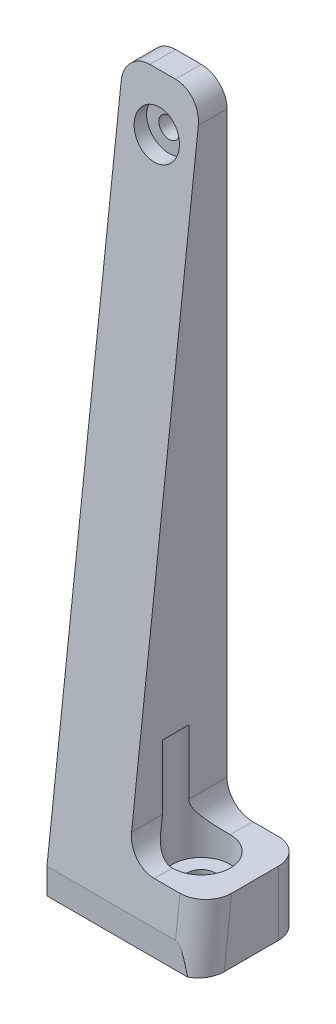
ISO-10303-21;
HEADER;
FILE_DESCRIPTION(('STEP AP214'),'2;1');
FILE_NAME('part.step','',(''),(''),'','','');
FILE_SCHEMA(('AUTOMOTIVE_DESIGN { 1 0 10303 214 1 1 1 1 }'));
ENDSEC;
DATA;
#1=APPLICATION_CONTEXT('core data for automotive mechanical design processes');
#2=APPLICATION_PROTOCOL_DEFINITION('international standard','automotive_design',2000,#1);
#3=PRODUCT_CONTEXT('',#1,'mechanical');
#4=PRODUCT('Part','Part','',(#3));
#5=PRODUCT_RELATED_PRODUCT_CATEGORY('part','',(#4));
#6=PRODUCT_DEFINITION_FORMATION('','',#4);
#7=PRODUCT_DEFINITION_CONTEXT('part definition',#1,'design');
#8=PRODUCT_DEFINITION('design','',#6,#7);
#9=PRODUCT_DEFINITION_SHAPE('','',#8);
#10=(LENGTH_UNIT() NAMED_UNIT(*) SI_UNIT(.MILLI.,.METRE.));
#11=(NAMED_UNIT(*) PLANE_ANGLE_UNIT() SI_UNIT($,.RADIAN.));
#12=(NAMED_UNIT(*) SI_UNIT($,.STERADIAN.) SOLID_ANGLE_UNIT());
#13=UNCERTAINTY_MEASURE_WITH_UNIT(LENGTH_MEASURE(1.E-05),#10,'distance_accuracy_value','');
#14=(GEOMETRIC_REPRESENTATION_CONTEXT(3) GLOBAL_UNCERTAINTY_ASSIGNED_CONTEXT((#13)) GLOBAL_UNIT_ASSIGNED_CONTEXT((#10,
#11,#12)) REPRESENTATION_CONTEXT('',''));
#15=CARTESIAN_POINT('',(0.,0.,0.));
#16=DIRECTION('',(0.,0.,1.));
#17=DIRECTION('',(1.,0.,0.));
#18=AXIS2_PLACEMENT_3D('',#15,#16,#17);
#19=CARTESIAN_POINT('',(-37.5,4.00000000000001,8.));
#20=DIRECTION('',(0.,-1.,0.));
#21=DIRECTION('',(1.,0.,0.));
#22=AXIS2_PLACEMENT_3D('',#19,#20,#21);
#23=CYLINDRICAL_SURFACE('',#22,2.2);
#24=CARTESIAN_POINT('',(-37.5,0.,8.));
#25=DIRECTION('',(0.,-1.,0.));
#26=DIRECTION('',(1.,0.,0.));
#27=AXIS2_PLACEMENT_3D('',#24,#25,#26);
#28=CIRCLE('',#27,2.2);
#29=CARTESIAN_POINT('',(-35.3,0.,8.));
#30=VERTEX_POINT('',#29);
#31=EDGE_CURVE('E197',#30,#30,#28,.T.);
#32=ORIENTED_EDGE('',*,*,#31,.T.);
#33=EDGE_LOOP('',(#32));
#34=FACE_BOUND('',#33,.T.);
#35=CARTESIAN_POINT('',(-37.5,6.00000000000001,8.));
#36=DIRECTION('',(0.,1.,0.));
#37=DIRECTION('',(-1.,0.,0.));
#38=AXIS2_PLACEMENT_3D('',#35,#36,#37);
#39=CIRCLE('',#38,2.2);
#40=CARTESIAN_POINT('',(-39.7,6.00000000000001,8.));
#41=VERTEX_POINT('',#40);
#42=EDGE_CURVE('E165',#41,#41,#39,.F.);
#43=ORIENTED_EDGE('',*,*,#42,.F.);
#44=EDGE_LOOP('',(#43));
#45=FACE_BOUND('',#44,.T.);
#46=ADVANCED_FACE('F39',(#34,#45),#23,.F.);
#47=CARTESIAN_POINT('',(-41.5,108.,4.));
#48=DIRECTION('',(-1.,0.,0.));
#49=DIRECTION('',(0.,-1.,0.));
#50=AXIS2_PLACEMENT_3D('',#47,#48,#49);
#51=PLANE('',#50);
#52=DIRECTION('',(0.,0.993408935871131,-0.11462410798513));
#53=VECTOR('',#52,1.);
#54=CARTESIAN_POINT('',(-41.5,108.,4.));
#55=LINE('',#54,#53);
#56=CARTESIAN_POINT('',(-41.5,14.,14.8461538461538));
#57=VERTEX_POINT('',#56);
#58=CARTESIAN_POINT('',(-41.5,104.,4.46153846153846));
#59=VERTEX_POINT('',#58);
#60=EDGE_CURVE('E188',#57,#59,#55,.T.);
#61=ORIENTED_EDGE('',*,*,#60,.F.);
#62=DIRECTION('',(0.,0.,1.));
#63=VECTOR('',#62,1.);
#64=CARTESIAN_POINT('',(-41.5,14.,4.));
#65=LINE('',#64,#63);
#66=CARTESIAN_POINT('',(-41.5,14.,10.0615528128088));
#67=VERTEX_POINT('',#66);
#68=EDGE_CURVE('E170',#57,#67,#65,.F.);
#69=ORIENTED_EDGE('',*,*,#68,.T.);
#70=DIRECTION('',(0.,-1.,0.));
#71=VECTOR('',#70,1.);
#72=CARTESIAN_POINT('',(-41.5,24.,10.0615528128088));
#73=LINE('',#72,#71);
#74=CARTESIAN_POINT('',(-41.5,24.,10.0615528128088));
#75=VERTEX_POINT('',#74);
#76=EDGE_CURVE('E161',#75,#67,#73,.T.);
#77=ORIENTED_EDGE('',*,*,#76,.F.);
#78=DIRECTION('',(0.,0.,-1.));
#79=VECTOR('',#78,1.);
#80=CARTESIAN_POINT('',(-41.5,24.,4.));
#81=LINE('',#80,#79);
#82=CARTESIAN_POINT('',(-41.5,24.,5.93844718719117));
#83=VERTEX_POINT('',#82);
#84=EDGE_CURVE('E145',#75,#83,#81,.T.);
#85=ORIENTED_EDGE('',*,*,#84,.T.);
#86=DIRECTION('',(0.,-1.,0.));
#87=VECTOR('',#86,1.);
#88=CARTESIAN_POINT('',(-41.5,24.,5.93844718719118));
#89=LINE('',#88,#87);
#90=CARTESIAN_POINT('',(-41.5,14.,5.93844718719118));
#91=VERTEX_POINT('',#90);
#92=EDGE_CURVE('E163',#91,#83,#89,.F.);
#93=ORIENTED_EDGE('',*,*,#92,.F.);
#94=DIRECTION('',(0.,0.,1.));
#95=VECTOR('',#94,1.);
#96=CARTESIAN_POINT('',(-41.5,14.,4.));
#97=LINE('',#96,#95);
#98=CARTESIAN_POINT('',(-41.5,14.,0.));
#99=VERTEX_POINT('',#98);
#100=EDGE_CURVE('E286',#91,#99,#97,.F.);
#101=ORIENTED_EDGE('',*,*,#100,.T.);
#102=DIRECTION('',(0.,1.,0.));
#103=VECTOR('',#102,1.);
#104=CARTESIAN_POINT('',(-41.5,108.,0.));
#105=LINE('',#104,#103);
#106=CARTESIAN_POINT('',(-41.5,104.,0.));
#107=VERTEX_POINT('',#106);
#108=EDGE_CURVE('E221',#99,#107,#105,.T.);
#109=ORIENTED_EDGE('',*,*,#108,.T.);
#110=DIRECTION('',(0.,0.,-1.));
#111=VECTOR('',#110,1.);
#112=CARTESIAN_POINT('',(-41.5,104.,4.));
#113=LINE('',#112,#111);
#114=EDGE_CURVE('E264',#107,#59,#113,.F.);
#115=ORIENTED_EDGE('',*,*,#114,.T.);
#116=EDGE_LOOP('',(#61,#69,#77,#85,#93,#101,#109,#115));
#117=FACE_BOUND('',#116,.T.);
#118=ADVANCED_FACE('F168',(#117),#51,.F.);
#119=CARTESIAN_POINT('',(0.,0.,0.));
#120=DIRECTION('',(0.,0.,-1.));
#121=DIRECTION('',(-1.,0.,0.));
#122=AXIS2_PLACEMENT_3D('',#119,#120,#121);
#123=PLANE('',#122);
#124=DIRECTION('',(-1.,0.,0.));
#125=VECTOR('',#124,1.);
#126=CARTESIAN_POINT('',(-29.5,10.,0.));
#127=LINE('',#126,#125);
#128=CARTESIAN_POINT('',(-33.5,10.,0.));
#129=VERTEX_POINT('',#128);
#130=CARTESIAN_POINT('',(-37.5,10.,0.));
#131=VERTEX_POINT('',#130);
#132=EDGE_CURVE('E180',#129,#131,#127,.T.);
#133=ORIENTED_EDGE('',*,*,#132,.F.);
#134=DIRECTION('',(0.,-1.,0.));
#135=VECTOR('',#134,1.);
#136=CARTESIAN_POINT('',(-33.5,0.,0.));
#137=LINE('',#136,#135);
#138=CARTESIAN_POINT('',(-33.5,0.,0.));
#139=VERTEX_POINT('',#138);
#140=EDGE_CURVE('E405',#129,#139,#137,.T.);
#141=ORIENTED_EDGE('',*,*,#140,.T.);
#142=DIRECTION('',(1.,0.,0.));
#143=VECTOR('',#142,1.);
#144=CARTESIAN_POINT('',(-41.5,0.,0.));
#145=LINE('',#144,#143);
#146=CARTESIAN_POINT('',(-53.5,0.,0.));
#147=VERTEX_POINT('',#146);
#148=EDGE_CURVE('E228',#147,#139,#145,.T.);
#149=ORIENTED_EDGE('',*,*,#148,.F.);
#150=DIRECTION('',(0.,-1.,0.));
#151=VECTOR('',#150,1.);
#152=CARTESIAN_POINT('',(-53.5,108.,0.));
#153=LINE('',#152,#151);
#154=CARTESIAN_POINT('',(-53.5,104.,0.));
#155=VERTEX_POINT('',#154);
#156=EDGE_CURVE('E225',#155,#147,#153,.T.);
#157=ORIENTED_EDGE('',*,*,#156,.F.);
#158=CARTESIAN_POINT('',(-49.5,104.,0.));
#159=DIRECTION('',(0.,0.,-1.));
#160=DIRECTION('',(-1.,0.,0.));
#161=AXIS2_PLACEMENT_3D('',#158,#159,#160);
#162=CIRCLE('',#161,4.);
#163=CARTESIAN_POINT('',(-49.5,108.,0.));
#164=VERTEX_POINT('',#163);
#165=EDGE_CURVE('E257',#155,#164,#162,.T.);
#166=ORIENTED_EDGE('',*,*,#165,.T.);
#167=DIRECTION('',(-1.,0.,0.));
#168=VECTOR('',#167,1.);
#169=CARTESIAN_POINT('',(-53.5,108.,0.));
#170=LINE('',#169,#168);
#171=CARTESIAN_POINT('',(-45.5,108.,0.));
#172=VERTEX_POINT('',#171);
#173=EDGE_CURVE('E216',#172,#164,#170,.T.);
#174=ORIENTED_EDGE('',*,*,#173,.F.);
#175=CARTESIAN_POINT('',(-45.5,104.,0.));
#176=DIRECTION('',(0.,0.,-1.));
#177=DIRECTION('',(-1.,0.,0.));
#178=AXIS2_PLACEMENT_3D('',#175,#176,#177);
#179=CIRCLE('',#178,4.);
#180=EDGE_CURVE('E260',#172,#107,#179,.T.);
#181=ORIENTED_EDGE('',*,*,#180,.T.);
#182=ORIENTED_EDGE('',*,*,#108,.F.);
#183=CARTESIAN_POINT('',(-37.5,14.,0.));
#184=DIRECTION('',(0.,0.,-1.));
#185=DIRECTION('',(-1.,0.,0.));
#186=AXIS2_PLACEMENT_3D('',#183,#184,#185);
#187=CIRCLE('',#186,4.);
#188=EDGE_CURVE('E408',#99,#131,#187,.F.);
#189=ORIENTED_EDGE('',*,*,#188,.T.);
#190=EDGE_LOOP('',(#133,#141,#149,#157,#166,#174,#181,#182,#189));
#191=FACE_BOUND('',#190,.T.);
#192=CARTESIAN_POINT('',(-47.5,100.,0.));
#193=DIRECTION('',(0.,0.,1.));
#194=DIRECTION('',(1.,0.,0.));
#195=AXIS2_PLACEMENT_3D('',#192,#193,#194);
#196=CIRCLE('',#195,1.6);
#197=CARTESIAN_POINT('',(-45.9,100.,0.));
#198=VERTEX_POINT('',#197);
#199=EDGE_CURVE('E212',#198,#198,#196,.T.);
#200=ORIENTED_EDGE('',*,*,#199,.T.);
#201=EDGE_LOOP('',(#200));
#202=FACE_BOUND('',#201,.T.);
#203=ADVANCED_FACE('F343',(#191,#202),#123,.T.);
#204=CARTESIAN_POINT('',(-53.5,108.,4.));
#205=DIRECTION('',(0.,-1.,0.));
#206=DIRECTION('',(0.,0.,-1.));
#207=AXIS2_PLACEMENT_3D('',#204,#205,#206);
#208=PLANE('',#207);
#209=DIRECTION('',(-1.,0.,0.));
#210=VECTOR('',#209,1.);
#211=CARTESIAN_POINT('',(-53.5,108.,4.));
#212=LINE('',#211,#210);
#213=CARTESIAN_POINT('',(-45.5,108.,4.));
#214=VERTEX_POINT('',#213);
#215=CARTESIAN_POINT('',(-49.5,108.,4.));
#216=VERTEX_POINT('',#215);
#217=EDGE_CURVE('E217',#214,#216,#212,.T.);
#218=ORIENTED_EDGE('',*,*,#217,.F.);
#219=DIRECTION('',(0.,0.,-1.));
#220=VECTOR('',#219,1.);
#221=CARTESIAN_POINT('',(-45.5,108.,4.));
#222=LINE('',#221,#220);
#223=EDGE_CURVE('E253',#214,#172,#222,.T.);
#224=ORIENTED_EDGE('',*,*,#223,.T.);
#225=ORIENTED_EDGE('',*,*,#173,.T.);
#226=DIRECTION('',(0.,0.,-1.));
#227=VECTOR('',#226,1.);
#228=CARTESIAN_POINT('',(-49.5,108.,4.));
#229=LINE('',#228,#227);
#230=EDGE_CURVE('E153',#164,#216,#229,.F.);
#231=ORIENTED_EDGE('',*,*,#230,.T.);
#232=EDGE_LOOP('',(#218,#224,#225,#231));
#233=FACE_BOUND('',#232,.T.);
#234=ADVANCED_FACE('F346',(#233),#208,.F.);
#235=CARTESIAN_POINT('',(-53.5,108.,4.));
#236=DIRECTION('',(1.,0.,0.));
#237=DIRECTION('',(0.,0.,-1.));
#238=AXIS2_PLACEMENT_3D('',#235,#236,#237);
#239=PLANE('',#238);
#240=DIRECTION('',(0.,0.993408935871131,-0.11462410798513));
#241=VECTOR('',#240,1.);
#242=CARTESIAN_POINT('',(-53.5,108.,4.));
#243=LINE('',#242,#241);
#244=CARTESIAN_POINT('',(-53.5,4.00000000000002,16.));
#245=VERTEX_POINT('',#244);
#246=CARTESIAN_POINT('',(-53.5,104.,4.46153846153846));
#247=VERTEX_POINT('',#246);
#248=EDGE_CURVE('E187',#245,#247,#243,.T.);
#249=ORIENTED_EDGE('',*,*,#248,.T.);
#250=DIRECTION('',(0.,0.,-1.));
#251=VECTOR('',#250,1.);
#252=CARTESIAN_POINT('',(-53.5,104.,4.));
#253=LINE('',#252,#251);
#254=EDGE_CURVE('E274',#247,#155,#253,.T.);
#255=ORIENTED_EDGE('',*,*,#254,.T.);
#256=ORIENTED_EDGE('',*,*,#156,.T.);
#257=DIRECTION('',(0.,0.,-1.));
#258=VECTOR('',#257,1.);
#259=CARTESIAN_POINT('',(-53.5,0.,4.));
#260=LINE('',#259,#258);
#261=CARTESIAN_POINT('',(-53.5,0.,16.));
#262=VERTEX_POINT('',#261);
#263=EDGE_CURVE('E154',#262,#147,#260,.T.);
#264=ORIENTED_EDGE('',*,*,#263,.F.);
#265=DIRECTION('',(0.,-1.,0.));
#266=VECTOR('',#265,1.);
#267=CARTESIAN_POINT('',(-53.5,4.00000000000002,16.));
#268=LINE('',#267,#266);
#269=EDGE_CURVE('E208',#245,#262,#268,.T.);
#270=ORIENTED_EDGE('',*,*,#269,.F.);
#271=EDGE_LOOP('',(#249,#255,#256,#264,#270));
#272=FACE_BOUND('',#271,.T.);
#273=ADVANCED_FACE('F352',(#272),#239,.F.);
#274=CARTESIAN_POINT('',(-41.5,0.,4.));
#275=DIRECTION('',(0.,1.,0.));
#276=DIRECTION('',(-1.,0.,0.));
#277=AXIS2_PLACEMENT_3D('',#274,#275,#276);
#278=PLANE('',#277);
#279=ORIENTED_EDGE('',*,*,#148,.T.);
#280=CARTESIAN_POINT('',(-33.5,0.,4.));
#281=DIRECTION('',(0.,1.,0.));
#282=DIRECTION('',(-1.,0.,0.));
#283=AXIS2_PLACEMENT_3D('',#280,#281,#282);
#284=CIRCLE('',#283,4.);
#285=CARTESIAN_POINT('',(-29.5,0.,4.));
#286=VERTEX_POINT('',#285);
#287=EDGE_CURVE('E399',#139,#286,#284,.F.);
#288=ORIENTED_EDGE('',*,*,#287,.T.);
#289=DIRECTION('',(0.,0.,1.));
#290=VECTOR('',#289,1.);
#291=CARTESIAN_POINT('',(-29.5,0.,0.));
#292=LINE('',#291,#290);
#293=CARTESIAN_POINT('',(-29.5,0.,12.4349992835993));
#294=VERTEX_POINT('',#293);
#295=EDGE_CURVE('E201',#286,#294,#292,.T.);
#296=ORIENTED_EDGE('',*,*,#295,.T.);
#297=CARTESIAN_POINT('',(-33.5,0.,12.4349992835993));
#298=DIRECTION('',(0.,1.,0.));
#299=DIRECTION('',(0.,0.,1.));
#300=AXIS2_PLACEMENT_3D('',#297,#298,#299);
#301=ELLIPSE('',#300,4.0265391779392,4.);
#302=CARTESIAN_POINT('',(-31.6404967121777,0.,16.));
#303=VERTEX_POINT('',#302);
#304=EDGE_CURVE('E402',#294,#303,#301,.F.);
#305=ORIENTED_EDGE('',*,*,#304,.T.);
#306=DIRECTION('',(-1.,0.,0.));
#307=VECTOR('',#306,1.);
#308=CARTESIAN_POINT('',(-29.5,0.,16.));
#309=LINE('',#308,#307);
#310=EDGE_CURVE('E205',#303,#262,#309,.T.);
#311=ORIENTED_EDGE('',*,*,#310,.T.);
#312=ORIENTED_EDGE('',*,*,#263,.T.);
#313=EDGE_LOOP('',(#279,#288,#296,#305,#311,#312));
#314=FACE_BOUND('',#313,.T.);
#315=ORIENTED_EDGE('',*,*,#31,.F.);
#316=EDGE_LOOP('',(#315));
#317=FACE_BOUND('',#316,.T.);
#318=ADVANCED_FACE('F341',(#314,#317),#278,.F.);
#319=CARTESIAN_POINT('',(-47.5,100.,4.));
#320=DIRECTION('',(0.,0.,-1.));
#321=DIRECTION('',(-1.,0.,0.));
#322=AXIS2_PLACEMENT_3D('',#319,#320,#321);
#323=CYLINDRICAL_SURFACE('',#322,1.6);
#324=CARTESIAN_POINT('',(-47.5,100.,3.));
#325=DIRECTION('',(0.,0.,-1.));
#326=DIRECTION('',(-1.,0.,0.));
#327=AXIS2_PLACEMENT_3D('',#324,#325,#326);
#328=CIRCLE('',#327,1.6);
#329=CARTESIAN_POINT('',(-49.1,100.,3.));
#330=VERTEX_POINT('',#329);
#331=EDGE_CURVE('E245',#330,#330,#328,.T.);
#332=ORIENTED_EDGE('',*,*,#331,.F.);
#333=EDGE_LOOP('',(#332));
#334=FACE_BOUND('',#333,.T.);
#335=ORIENTED_EDGE('',*,*,#199,.F.);
#336=EDGE_LOOP('',(#335));
#337=FACE_BOUND('',#336,.T.);
#338=ADVANCED_FACE('F335',(#334,#337),#323,.F.);
#339=CARTESIAN_POINT('',(-29.5,4.00000000000001,16.));
#340=DIRECTION('',(0.,0.,1.));
#341=DIRECTION('',(1.,0.,0.));
#342=AXIS2_PLACEMENT_3D('',#339,#340,#341);
#343=PLANE('',#342);
#344=ORIENTED_EDGE('',*,*,#310,.F.);
#345=CARTESIAN_POINT('',(-33.5,-30.8966728754731,16.));
#346=DIRECTION('',(0.,0.,1.));
#347=DIRECTION('',(0.,-1.,0.));
#348=AXIS2_PLACEMENT_3D('',#345,#346,#347);
#349=ELLIPSE('',#348,34.8966728754731,4.);
#350=CARTESIAN_POINT('',(-33.5,4.00000000000002,16.));
#351=VERTEX_POINT('',#350);
#352=EDGE_CURVE('E48',#303,#351,#349,.T.);
#353=ORIENTED_EDGE('',*,*,#352,.T.);
#354=DIRECTION('',(-1.,0.,0.));
#355=VECTOR('',#354,1.);
#356=CARTESIAN_POINT('',(-41.5,4.00000000000002,16.));
#357=LINE('',#356,#355);
#358=EDGE_CURVE('E191',#351,#245,#357,.T.);
#359=ORIENTED_EDGE('',*,*,#358,.T.);
#360=ORIENTED_EDGE('',*,*,#269,.T.);
#361=EDGE_LOOP('',(#344,#353,#359,#360));
#362=FACE_BOUND('',#361,.T.);
#363=ADVANCED_FACE('F332',(#362),#343,.T.);
#364=CARTESIAN_POINT('',(-29.5,4.00000000000001,0.));
#365=DIRECTION('',(1.,0.,0.));
#366=DIRECTION('',(0.,1.,0.));
#367=AXIS2_PLACEMENT_3D('',#364,#365,#366);
#368=PLANE('',#367);
#369=ORIENTED_EDGE('',*,*,#295,.F.);
#370=DIRECTION('',(0.,-1.,0.));
#371=VECTOR('',#370,1.);
#372=CARTESIAN_POINT('',(-29.5,4.00000000000001,4.));
#373=LINE('',#372,#371);
#374=CARTESIAN_POINT('',(-29.5,10.,4.));
#375=VERTEX_POINT('',#374);
#376=EDGE_CURVE('E389',#286,#375,#373,.F.);
#377=ORIENTED_EDGE('',*,*,#376,.T.);
#378=DIRECTION('',(0.,0.,-1.));
#379=VECTOR('',#378,1.);
#380=CARTESIAN_POINT('',(-29.5,10.,16.));
#381=LINE('',#380,#379);
#382=CARTESIAN_POINT('',(-29.5,10.,11.2811531297531));
#383=VERTEX_POINT('',#382);
#384=EDGE_CURVE('E183',#383,#375,#381,.T.);
#385=ORIENTED_EDGE('',*,*,#384,.F.);
#386=DIRECTION('',(0.,-0.993408935871131,0.11462410798513));
#387=VECTOR('',#386,1.);
#388=CARTESIAN_POINT('',(-29.5,5.36340137827846,11.8161452784133));
#389=LINE('',#388,#387);
#390=EDGE_CURVE('E385',#383,#294,#389,.T.);
#391=ORIENTED_EDGE('',*,*,#390,.T.);
#392=EDGE_LOOP('',(#369,#377,#385,#391));
#393=FACE_BOUND('',#392,.T.);
#394=ADVANCED_FACE('F327',(#393),#368,.T.);
#395=CARTESIAN_POINT('',(-41.5,108.,4.));
#396=DIRECTION('',(0.,0.11462410798513,0.993408935871131));
#397=DIRECTION('',(0.,-0.993408935871131,0.11462410798513));
#398=AXIS2_PLACEMENT_3D('',#395,#396,#397);
#399=PLANE('',#398);
#400=CARTESIAN_POINT('',(-47.5,100.,4.92307692307692));
#401=DIRECTION('',(0.,0.11462410798513,0.993408935871131));
#402=DIRECTION('',(0.,0.993408935871131,-0.11462410798513));
#403=AXIS2_PLACEMENT_3D('',#400,#401,#402);
#404=ELLIPSE('',#403,3.5232217806968,3.5);
#405=CARTESIAN_POINT('',(-47.5,103.5,4.51923076923077));
#406=VERTEX_POINT('',#405);
#407=EDGE_CURVE('E241',#406,#406,#404,.T.);
#408=ORIENTED_EDGE('',*,*,#407,.F.);
#409=EDGE_LOOP('',(#408));
#410=FACE_BOUND('',#409,.T.);
#411=ORIENTED_EDGE('',*,*,#358,.F.);
#412=DIRECTION('',(0.,-0.993408935871131,0.11462410798513));
#413=VECTOR('',#412,1.);
#414=CARTESIAN_POINT('',(-33.5,108.,4.));
#415=LINE('',#414,#413);
#416=CARTESIAN_POINT('',(-33.5,10.,15.3076923076923));
#417=VERTEX_POINT('',#416);
#418=EDGE_CURVE('E11',#351,#417,#415,.F.);
#419=ORIENTED_EDGE('',*,*,#418,.T.);
#420=DIRECTION('',(-1.,0.,0.));
#421=VECTOR('',#420,1.);
#422=CARTESIAN_POINT('',(-29.5,10.,15.3076923076923));
#423=LINE('',#422,#421);
#424=CARTESIAN_POINT('',(-37.5,10.,15.3076923076923));
#425=VERTEX_POINT('',#424);
#426=EDGE_CURVE('E174',#417,#425,#423,.T.);
#427=ORIENTED_EDGE('',*,*,#426,.T.);
#428=CARTESIAN_POINT('',(-37.5,14.,14.8461538461538));
#429=DIRECTION('',(0.,0.11462410798513,0.993408935871131));
#430=DIRECTION('',(0.,-0.993408935871131,0.114624107985131));
#431=AXIS2_PLACEMENT_3D('',#428,#429,#430);
#432=ELLIPSE('',#431,4.0265391779392,4.);
#433=EDGE_CURVE('E291',#425,#57,#432,.F.);
#434=ORIENTED_EDGE('',*,*,#433,.T.);
#435=ORIENTED_EDGE('',*,*,#60,.T.);
#436=CARTESIAN_POINT('',(-45.5,104.,4.46153846153846));
#437=DIRECTION('',(0.,0.11462410798513,0.993408935871131));
#438=DIRECTION('',(0.,0.993408935871131,-0.114624107985131));
#439=AXIS2_PLACEMENT_3D('',#436,#437,#438);
#440=ELLIPSE('',#439,4.0265391779392,4.);
#441=EDGE_CURVE('E271',#59,#214,#440,.T.);
#442=ORIENTED_EDGE('',*,*,#441,.T.);
#443=ORIENTED_EDGE('',*,*,#217,.T.);
#444=CARTESIAN_POINT('',(-49.5,104.,4.46153846153846));
#445=DIRECTION('',(0.,0.11462410798513,0.993408935871131));
#446=DIRECTION('',(0.,0.993408935871131,-0.114624107985131));
#447=AXIS2_PLACEMENT_3D('',#444,#445,#446);
#448=ELLIPSE('',#447,4.0265391779392,4.);
#449=EDGE_CURVE('E268',#216,#247,#448,.T.);
#450=ORIENTED_EDGE('',*,*,#449,.T.);
#451=ORIENTED_EDGE('',*,*,#248,.F.);
#452=EDGE_LOOP('',(#411,#419,#427,#434,#435,#442,#443,#450,#451));
#453=FACE_BOUND('',#452,.T.);
#454=ADVANCED_FACE('F323',(#410,#453),#399,.T.);
#455=CARTESIAN_POINT('',(0.,10.,0.));
#456=DIRECTION('',(0.,1.,0.));
#457=DIRECTION('',(-1.,0.,0.));
#458=AXIS2_PLACEMENT_3D('',#455,#456,#457);
#459=PLANE('',#458);
#460=ORIENTED_EDGE('',*,*,#384,.T.);
#461=CARTESIAN_POINT('',(-33.5,10.,4.));
#462=DIRECTION('',(0.,1.,0.));
#463=DIRECTION('',(-1.,0.,0.));
#464=AXIS2_PLACEMENT_3D('',#461,#462,#463);
#465=CIRCLE('',#464,4.);
#466=EDGE_CURVE('E388',#375,#129,#465,.T.);
#467=ORIENTED_EDGE('',*,*,#466,.T.);
#468=ORIENTED_EDGE('',*,*,#132,.T.);
#469=DIRECTION('',(0.,0.,1.));
#470=VECTOR('',#469,1.);
#471=CARTESIAN_POINT('',(-37.5,10.,0.));
#472=LINE('',#471,#470);
#473=CARTESIAN_POINT('',(-37.5,10.,3.5));
#474=VERTEX_POINT('',#473);
#475=EDGE_CURVE('E278',#131,#474,#472,.T.);
#476=ORIENTED_EDGE('',*,*,#475,.T.);
#477=CARTESIAN_POINT('',(-37.5,10.,8.));
#478=DIRECTION('',(0.,1.,0.));
#479=DIRECTION('',(-1.,0.,0.));
#480=AXIS2_PLACEMENT_3D('',#477,#478,#479);
#481=CIRCLE('',#480,4.5);
#482=CARTESIAN_POINT('',(-37.5,10.,12.5));
#483=VERTEX_POINT('',#482);
#484=EDGE_CURVE('E250',#483,#474,#481,.T.);
#485=ORIENTED_EDGE('',*,*,#484,.F.);
#486=DIRECTION('',(0.,0.,1.));
#487=VECTOR('',#486,1.);
#488=CARTESIAN_POINT('',(-37.5,10.,0.));
#489=LINE('',#488,#487);
#490=EDGE_CURVE('E282',#483,#425,#489,.T.);
#491=ORIENTED_EDGE('',*,*,#490,.T.);
#492=ORIENTED_EDGE('',*,*,#426,.F.);
#493=CARTESIAN_POINT('',(-33.5,10.,11.2811531297531));
#494=DIRECTION('',(0.,1.,0.));
#495=DIRECTION('',(0.,0.,1.));
#496=AXIS2_PLACEMENT_3D('',#493,#494,#495);
#497=ELLIPSE('',#496,4.0265391779392,4.);
#498=EDGE_CURVE('E383',#417,#383,#497,.T.);
#499=ORIENTED_EDGE('',*,*,#498,.T.);
#500=EDGE_LOOP('',(#460,#467,#468,#476,#485,#491,#492,#499));
#501=FACE_BOUND('',#500,.T.);
#502=ADVANCED_FACE('F319',(#501),#459,.T.);
#503=CARTESIAN_POINT('',(-37.5,24.,8.));
#504=DIRECTION('',(0.,1.,0.));
#505=DIRECTION('',(-1.,0.,0.));
#506=AXIS2_PLACEMENT_3D('',#503,#504,#505);
#507=PLANE('',#506);
#508=CARTESIAN_POINT('',(-37.5,24.,8.));
#509=DIRECTION('',(0.,1.,0.));
#510=DIRECTION('',(-1.,0.,0.));
#511=AXIS2_PLACEMENT_3D('',#508,#509,#510);
#512=CIRCLE('',#511,4.5);
#513=EDGE_CURVE('E148',#83,#75,#512,.T.);
#514=ORIENTED_EDGE('',*,*,#513,.F.);
#515=ORIENTED_EDGE('',*,*,#84,.F.);
#516=EDGE_LOOP('',(#514,#515));
#517=FACE_BOUND('',#516,.T.);
#518=ADVANCED_FACE('F147',(#517),#507,.F.);
#519=CARTESIAN_POINT('',(-37.5,24.,8.));
#520=DIRECTION('',(0.,-1.,0.));
#521=DIRECTION('',(1.,0.,0.));
#522=AXIS2_PLACEMENT_3D('',#519,#520,#521);
#523=CYLINDRICAL_SURFACE('',#522,4.5);
#524=ORIENTED_EDGE('',*,*,#484,.T.);
#525=CARTESIAN_POINT('',(-37.5,10.,3.5));
#526=CARTESIAN_POINT('',(-37.5935869277815,9.99997800695673,3.49997732016334));
#527=CARTESIAN_POINT('',(-37.687156797297,10.0032836887174,3.50291876284296));
#528=CARTESIAN_POINT('',(-37.8734143333226,10.0163804736635,3.5145559746189));
#529=CARTESIAN_POINT('',(-37.9661025981245,10.0261668046063,3.52324750943817));
#530=CARTESIAN_POINT('',(-38.1491468000912,10.051950895096,3.54611874203927));
#531=CARTESIAN_POINT('',(-38.2395155267506,10.0678978611754,3.56025355788471));
#532=CARTESIAN_POINT('',(-38.4180157282959,10.1056987412168,3.59369703334118));
#533=CARTESIAN_POINT('',(-38.5061469027344,10.1275534438993,3.6130063837827));
#534=CARTESIAN_POINT('',(-38.7658277286531,10.201326919836,3.67803669178848));
#535=CARTESIAN_POINT('',(-38.9333270330033,10.2615519478014,3.73094659330094));
#536=CARTESIAN_POINT('',(-39.2542611124496,10.4009224153535,3.85244586413752));
#537=CARTESIAN_POINT('',(-39.4076648652779,10.4801082671283,3.92106870942376));
#538=CARTESIAN_POINT('',(-39.7559391704925,10.6884354919409,4.09968040752454));
#539=CARTESIAN_POINT('',(-39.9435168498034,10.8249952216363,4.21534377942057));
#540=CARTESIAN_POINT('',(-40.2013307346172,11.0477478038759,4.39943526585387));
#541=CARTESIAN_POINT('',(-40.2834444706305,11.1251085661798,4.46266391438559));
#542=CARTESIAN_POINT('',(-40.4399407571454,11.2853600091235,4.59162794643619));
#543=CARTESIAN_POINT('',(-40.5143259403957,11.3682487907284,4.65736246582516));
#544=CARTESIAN_POINT('',(-40.6570064992906,11.5411066126383,4.79170929534566));
#545=CARTESIAN_POINT('',(-40.7251306645027,11.6311917503987,4.86035309831985));
#546=CARTESIAN_POINT('',(-40.8535015286027,11.8167100005457,4.99785575690581));
#547=CARTESIAN_POINT('',(-40.913745958653,11.912144641982,5.06671466863667));
#548=CARTESIAN_POINT('',(-41.0263224477614,12.1084772015641,5.20306277743122));
#549=CARTESIAN_POINT('',(-41.0786562798222,12.2093738885955,5.27055227847644));
#550=CARTESIAN_POINT('',(-41.1752385804629,12.4170509512852,5.40206474617694));
#551=CARTESIAN_POINT('',(-41.2194924828965,12.5238273094238,5.46609002202591));
#552=CARTESIAN_POINT('',(-41.3025429528411,12.7523768640452,5.59235052911703));
#553=CARTESIAN_POINT('',(-41.3406781881425,12.8746739379656,5.65408843951791));
#554=CARTESIAN_POINT('',(-41.4057912019411,13.1272736828094,5.76418567723444));
#555=CARTESIAN_POINT('',(-41.4328415178264,13.2575176840495,5.81263127344617));
#556=CARTESIAN_POINT('',(-41.4684969943952,13.489380663872,5.8781965051382));
#557=CARTESIAN_POINT('',(-41.4801244173054,13.5890750701833,5.90026118955214));
#558=CARTESIAN_POINT('',(-41.4919516231496,13.7412307617615,5.92288835694849));
#559=CARTESIAN_POINT('',(-41.4949591749726,13.7927189856223,5.92868847826483));
#560=CARTESIAN_POINT('',(-41.4989875610931,13.8961289417571,5.93648195442941));
#561=CARTESIAN_POINT('',(-41.5000056558492,13.9480511730703,5.93847005994807));
#562=CARTESIAN_POINT('',(-41.5,14.,5.93844718719113));
#563=B_SPLINE_CURVE_WITH_KNOTS('',3,(#525,#526,#527,#528,#529,#530,#531,#532,#533,#534,#535,
#536,#537,#538,#539,#540,#541,#542,#543,#544,#545,#546,#547,#548,#549,#550,#551,#552,#553,#554,
#555,#556,#557,#558,#559,#560,#561,#562),.UNSPECIFIED.,.F.,.F.,(4,2,2,2,2,2,2,2,2,2,2,2,2,2,2,2,
2,2,4),(0.,0.280628406979089,0.561050393307285,0.839208057613605,1.11740287610307,
1.67179423998445,2.2273778926858,3.00057555114543,3.38829291333553,3.77587776269374,
4.17204043572344,4.56831692721267,4.96450446911055,5.36042458055966,5.78614020494531,
6.20902375173169,6.51613986750651,6.6716773354168,6.82742883253023),.UNSPECIFIED.);
#564=EDGE_CURVE('E303',#474,#91,#563,.T.);
#565=ORIENTED_EDGE('',*,*,#564,.T.);
#566=ORIENTED_EDGE('',*,*,#92,.T.);
#567=ORIENTED_EDGE('',*,*,#513,.T.);
#568=ORIENTED_EDGE('',*,*,#76,.T.);
#569=CARTESIAN_POINT('',(-41.5,14.,10.0615528128088));
#570=CARTESIAN_POINT('',(-41.5000155768564,13.9372367308244,10.0614946775051));
#571=CARTESIAN_POINT('',(-41.4985235386135,13.8745129894339,10.0644177155635));
#572=CARTESIAN_POINT('',(-41.4926528598452,13.7498542576007,10.0757633938085));
#573=CARTESIAN_POINT('',(-41.488281495451,13.6879176790649,10.0841721708807));
#574=CARTESIAN_POINT('',(-41.4768799581347,13.566291629854,10.1058401713004));
#575=CARTESIAN_POINT('',(-41.469897498057,13.5065818074312,10.1190122203163));
#576=CARTESIAN_POINT('',(-41.4534423206775,13.3885715427146,10.1495573474808));
#577=CARTESIAN_POINT('',(-41.4439678513785,13.3302721236126,10.1669333805319));
#578=CARTESIAN_POINT('',(-41.4176608927338,13.1879839924233,10.2142648241426));
#579=CARTESIAN_POINT('',(-41.3994701812385,13.1049314627165,10.2462769808714));
#580=CARTESIAN_POINT('',(-41.3585545996425,12.9423648954616,10.3158553633833));
#581=CARTESIAN_POINT('',(-41.3358274173946,12.8628526877233,10.353424418866));
#582=CARTESIAN_POINT('',(-41.2859524001824,12.7064122323948,10.4328552019245));
#583=CARTESIAN_POINT('',(-41.258763694152,12.6295166645273,10.4747551491688));
#584=CARTESIAN_POINT('',(-41.2003513289189,12.4788396724066,10.5612753396795));
#585=CARTESIAN_POINT('',(-41.1691261956842,12.4050593989265,10.605896573552));
#586=CARTESIAN_POINT('',(-41.081253900533,12.2134215478651,10.7263922959353));
#587=CARTESIAN_POINT('',(-41.0212574204478,12.0980256429766,10.8037600137751));
#588=CARTESIAN_POINT('',(-40.8909082783797,11.8743242550421,10.9600898617294));
#589=CARTESIAN_POINT('',(-40.8205496132177,11.7660229350426,11.0390528930303));
#590=CARTESIAN_POINT('',(-40.6696654850104,11.5566799650746,11.1960981140677));
#591=CARTESIAN_POINT('',(-40.5891696547173,11.4556184507486,11.2741821763209));
#592=CARTESIAN_POINT('',(-40.4177766679973,11.2607657529866,11.4278022960806));
#593=CARTESIAN_POINT('',(-40.3268844779944,11.1669711337197,11.5033395480735));
#594=CARTESIAN_POINT('',(-40.0838610150479,10.9399281296902,11.688869638711));
#595=CARTESIAN_POINT('',(-39.9246467464296,10.8118451662036,11.7961115617957));
#596=CARTESIAN_POINT('',(-39.581625982894,10.5780484483069,11.9944921586391));
#597=CARTESIAN_POINT('',(-39.3978505650695,10.4723068548425,12.0856508496766));
#598=CARTESIAN_POINT('',(-39.0451061894216,10.3063532784273,12.2298568665661));
#599=CARTESIAN_POINT('',(-38.8800486890992,10.2412994863127,12.2868599505602));
#600=CARTESIAN_POINT('',(-38.5379811422018,10.1328804064039,12.3822306779714));
#601=CARTESIAN_POINT('',(-38.3609963525321,10.0894708278991,12.4206363726776));
#602=CARTESIAN_POINT('',(-38.0689627913542,10.0390543211306,12.4653122472997));
#603=CARTESIAN_POINT('',(-37.9561746469432,10.0244720164398,12.4782573856558));
#604=CARTESIAN_POINT('',(-37.7289546272975,10.0049195934772,12.4956268429097));
#605=CARTESIAN_POINT('',(-37.6145205556903,9.99996381212633,12.5000384526585));
#606=CARTESIAN_POINT('',(-37.5,10.,12.5));
#607=B_SPLINE_CURVE_WITH_KNOTS('',3,(#569,#570,#571,#572,#573,#574,#575,#576,#577,#578,#579,
#580,#581,#582,#583,#584,#585,#586,#587,#588,#589,#590,#591,#592,#593,#594,#595,#596,#597,#598,
#599,#600,#601,#602,#603,#604,#605,#606),.UNSPECIFIED.,.F.,.F.,(4,2,2,2,2,2,2,2,2,2,2,2,2,2,2,2,
2,2,4),(0.,0.188140947284096,0.375808272236812,0.560201767343891,0.744725247693048,
1.01680277287632,1.28901932618973,1.56388521462064,1.83885176430151,2.29222647389656,
2.7458648802459,3.19820673040138,3.65033338868983,4.34002941424762,5.02886089011197,
5.58568901362802,6.14137297081858,6.48407612367843,6.82728927917519),.UNSPECIFIED.);
#608=EDGE_CURVE('E294',#67,#483,#607,.T.);
#609=ORIENTED_EDGE('',*,*,#608,.T.);
#610=EDGE_LOOP('',(#524,#565,#566,#567,#568,#609));
#611=FACE_BOUND('',#610,.T.);
#612=CARTESIAN_POINT('',(-37.5,6.00000000000001,8.));
#613=DIRECTION('',(0.,1.,0.));
#614=DIRECTION('',(-1.,0.,0.));
#615=AXIS2_PLACEMENT_3D('',#612,#613,#614);
#616=CIRCLE('',#615,4.5);
#617=CARTESIAN_POINT('',(-42.,6.00000000000001,8.));
#618=VERTEX_POINT('',#617);
#619=EDGE_CURVE('E240',#618,#618,#616,.T.);
#620=ORIENTED_EDGE('',*,*,#619,.F.);
#621=EDGE_LOOP('',(#620));
#622=FACE_BOUND('',#621,.T.);
#623=ADVANCED_FACE('F159',(#611,#622),#523,.F.);
#624=CARTESIAN_POINT('',(-37.5,6.00000000000001,8.));
#625=DIRECTION('',(0.,1.,0.));
#626=DIRECTION('',(-1.,0.,0.));
#627=AXIS2_PLACEMENT_3D('',#624,#625,#626);
#628=PLANE('',#627);
#629=ORIENTED_EDGE('',*,*,#619,.T.);
#630=EDGE_LOOP('',(#629));
#631=FACE_BOUND('',#630,.T.);
#632=ORIENTED_EDGE('',*,*,#42,.T.);
#633=EDGE_LOOP('',(#632));
#634=FACE_BOUND('',#633,.T.);
#635=ADVANCED_FACE('F317',(#631,#634),#628,.T.);
#636=CARTESIAN_POINT('',(-47.5,100.,16.));
#637=DIRECTION('',(0.,0.,-1.));
#638=DIRECTION('',(-1.,0.,0.));
#639=AXIS2_PLACEMENT_3D('',#636,#637,#638);
#640=CYLINDRICAL_SURFACE('',#639,3.5);
#641=ORIENTED_EDGE('',*,*,#407,.T.);
#642=EDGE_LOOP('',(#641));
#643=FACE_BOUND('',#642,.T.);
#644=CARTESIAN_POINT('',(-47.5,100.,3.));
#645=DIRECTION('',(0.,0.,-1.));
#646=DIRECTION('',(-1.,0.,0.));
#647=AXIS2_PLACEMENT_3D('',#644,#645,#646);
#648=CIRCLE('',#647,3.5);
#649=CARTESIAN_POINT('',(-51.,100.,3.));
#650=VERTEX_POINT('',#649);
#651=EDGE_CURVE('E246',#650,#650,#648,.T.);
#652=ORIENTED_EDGE('',*,*,#651,.T.);
#653=EDGE_LOOP('',(#652));
#654=FACE_BOUND('',#653,.T.);
#655=ADVANCED_FACE('F439',(#643,#654),#640,.F.);
#656=CARTESIAN_POINT('',(-47.5,100.,3.));
#657=DIRECTION('',(0.,0.,-1.));
#658=DIRECTION('',(-1.,0.,0.));
#659=AXIS2_PLACEMENT_3D('',#656,#657,#658);
#660=PLANE('',#659);
#661=ORIENTED_EDGE('',*,*,#331,.T.);
#662=EDGE_LOOP('',(#661));
#663=FACE_BOUND('',#662,.T.);
#664=ORIENTED_EDGE('',*,*,#651,.F.);
#665=EDGE_LOOP('',(#664));
#666=FACE_BOUND('',#665,.T.);
#667=ADVANCED_FACE('F363',(#663,#666),#660,.F.);
#668=CARTESIAN_POINT('',(-45.5,104.,4.));
#669=DIRECTION('',(0.,0.,-1.));
#670=DIRECTION('',(-1.,0.,0.));
#671=AXIS2_PLACEMENT_3D('',#668,#669,#670);
#672=CYLINDRICAL_SURFACE('',#671,4.);
#673=ORIENTED_EDGE('',*,*,#441,.F.);
#674=ORIENTED_EDGE('',*,*,#114,.F.);
#675=ORIENTED_EDGE('',*,*,#180,.F.);
#676=ORIENTED_EDGE('',*,*,#223,.F.);
#677=EDGE_LOOP('',(#673,#674,#675,#676));
#678=FACE_BOUND('',#677,.T.);
#679=ADVANCED_FACE('F360',(#678),#672,.T.);
#680=CARTESIAN_POINT('',(-49.5,104.,4.));
#681=DIRECTION('',(0.,0.,-1.));
#682=DIRECTION('',(-1.,0.,0.));
#683=AXIS2_PLACEMENT_3D('',#680,#681,#682);
#684=CYLINDRICAL_SURFACE('',#683,4.);
#685=ORIENTED_EDGE('',*,*,#449,.F.);
#686=ORIENTED_EDGE('',*,*,#230,.F.);
#687=ORIENTED_EDGE('',*,*,#165,.F.);
#688=ORIENTED_EDGE('',*,*,#254,.F.);
#689=EDGE_LOOP('',(#685,#686,#687,#688));
#690=FACE_BOUND('',#689,.T.);
#691=ADVANCED_FACE('F362',(#690),#684,.T.);
#692=CARTESIAN_POINT('',(-37.5,14.,0.));
#693=DIRECTION('',(0.,0.,1.));
#694=DIRECTION('',(0.,-1.,0.));
#695=AXIS2_PLACEMENT_3D('',#692,#693,#694);
#696=CYLINDRICAL_SURFACE('',#695,4.);
#697=ORIENTED_EDGE('',*,*,#608,.F.);
#698=ORIENTED_EDGE('',*,*,#68,.F.);
#699=ORIENTED_EDGE('',*,*,#433,.F.);
#700=ORIENTED_EDGE('',*,*,#490,.F.);
#701=EDGE_LOOP('',(#697,#698,#699,#700));
#702=FACE_BOUND('',#701,.T.);
#703=ADVANCED_FACE('F310',(#702),#696,.F.);
#704=CARTESIAN_POINT('',(-37.5,14.,0.));
#705=DIRECTION('',(0.,0.,1.));
#706=DIRECTION('',(0.,-1.,0.));
#707=AXIS2_PLACEMENT_3D('',#704,#705,#706);
#708=CYLINDRICAL_SURFACE('',#707,4.);
#709=ORIENTED_EDGE('',*,*,#188,.F.);
#710=ORIENTED_EDGE('',*,*,#100,.F.);
#711=ORIENTED_EDGE('',*,*,#564,.F.);
#712=ORIENTED_EDGE('',*,*,#475,.F.);
#713=EDGE_LOOP('',(#709,#710,#711,#712));
#714=FACE_BOUND('',#713,.T.);
#715=ADVANCED_FACE('F370',(#714),#708,.F.);
#716=CARTESIAN_POINT('',(-33.5,0.,4.));
#717=DIRECTION('',(0.,-1.,0.));
#718=DIRECTION('',(1.,0.,0.));
#719=AXIS2_PLACEMENT_3D('',#716,#717,#718);
#720=CYLINDRICAL_SURFACE('',#719,4.);
#721=ORIENTED_EDGE('',*,*,#466,.F.);
#722=ORIENTED_EDGE('',*,*,#376,.F.);
#723=ORIENTED_EDGE('',*,*,#287,.F.);
#724=ORIENTED_EDGE('',*,*,#140,.F.);
#725=EDGE_LOOP('',(#721,#722,#723,#724));
#726=FACE_BOUND('',#725,.T.);
#727=ADVANCED_FACE('F425',(#726),#720,.T.);
#728=CARTESIAN_POINT('',(-33.5,5.36340137827846,11.8161452784133));
#729=DIRECTION('',(0.,-0.993408935871131,0.11462410798513));
#730=DIRECTION('',(0.,-0.11462410798513,-0.993408935871131));
#731=AXIS2_PLACEMENT_3D('',#728,#729,#730);
#732=CYLINDRICAL_SURFACE('',#731,4.);
#733=ORIENTED_EDGE('',*,*,#498,.F.);
#734=ORIENTED_EDGE('',*,*,#418,.F.);
#735=ORIENTED_EDGE('',*,*,#352,.F.);
#736=ORIENTED_EDGE('',*,*,#304,.F.);
#737=ORIENTED_EDGE('',*,*,#390,.F.);
#738=EDGE_LOOP('',(#733,#734,#735,#736,#737));
#739=FACE_BOUND('',#738,.T.);
#740=ADVANCED_FACE('F41',(#739),#732,.T.);
#741=CLOSED_SHELL('',(#46,#118,#203,#234,#273,#318,#338,#363,#394,#454,#502,#518,#623,#635,#655,
#667,#679,#691,#703,#715,#727,#740));
#742=MANIFOLD_SOLID_BREP('B2',#741);
#743=ADVANCED_BREP_SHAPE_REPRESENTATION('',(#18,#742),#14);
#744=SHAPE_DEFINITION_REPRESENTATION(#9,#743);
ENDSEC;
END-ISO-10303-21;
